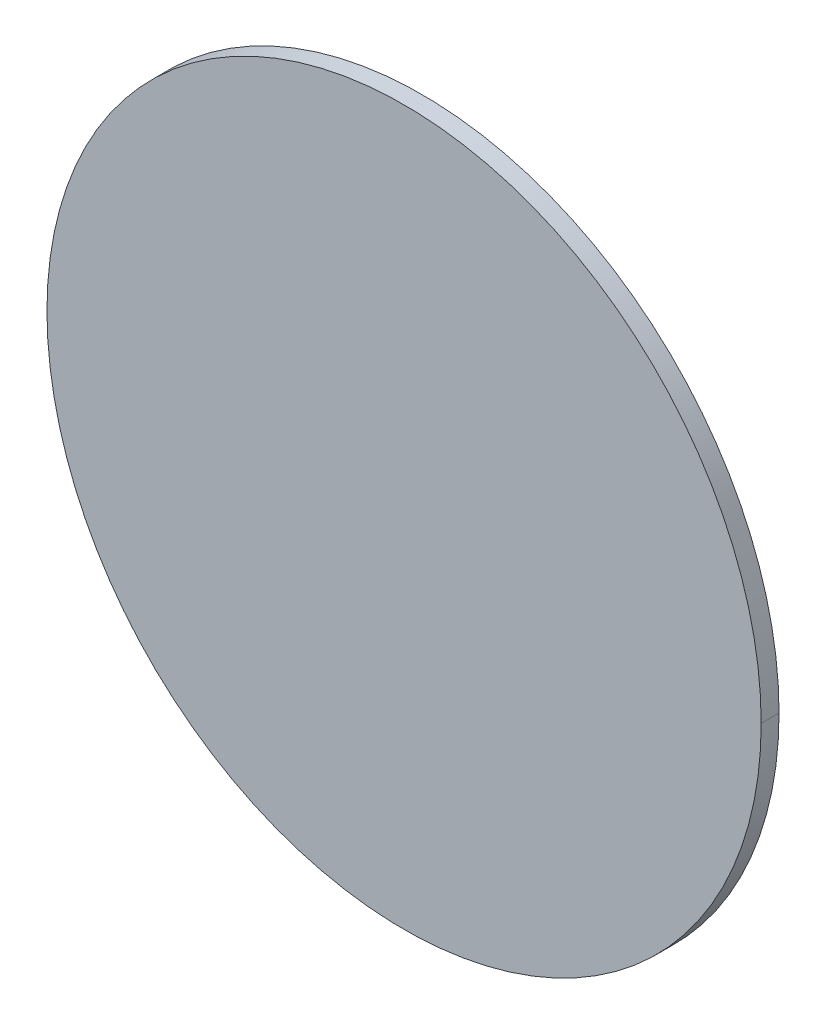
ISO-10303-21;
HEADER;
FILE_DESCRIPTION(('STEP AP214'),'2;1');
FILE_NAME('part.step','',(''),(''),'','','');
FILE_SCHEMA(('AUTOMOTIVE_DESIGN { 1 0 10303 214 1 1 1 1 }'));
ENDSEC;
DATA;
#1=APPLICATION_CONTEXT('core data for automotive mechanical design processes');
#2=APPLICATION_PROTOCOL_DEFINITION('international standard','automotive_design',2000,#1);
#3=PRODUCT_CONTEXT('',#1,'mechanical');
#4=PRODUCT('Part','Part','',(#3));
#5=PRODUCT_RELATED_PRODUCT_CATEGORY('part','',(#4));
#6=PRODUCT_DEFINITION_FORMATION('','',#4);
#7=PRODUCT_DEFINITION_CONTEXT('part definition',#1,'design');
#8=PRODUCT_DEFINITION('design','',#6,#7);
#9=PRODUCT_DEFINITION_SHAPE('','',#8);
#10=(LENGTH_UNIT() NAMED_UNIT(*) SI_UNIT(.MILLI.,.METRE.));
#11=(NAMED_UNIT(*) PLANE_ANGLE_UNIT() SI_UNIT($,.RADIAN.));
#12=(NAMED_UNIT(*) SI_UNIT($,.STERADIAN.) SOLID_ANGLE_UNIT());
#13=UNCERTAINTY_MEASURE_WITH_UNIT(LENGTH_MEASURE(1.E-05),#10,'distance_accuracy_value','');
#14=(GEOMETRIC_REPRESENTATION_CONTEXT(3) GLOBAL_UNCERTAINTY_ASSIGNED_CONTEXT((#13)) GLOBAL_UNIT_ASSIGNED_CONTEXT((#10,
#11,#12)) REPRESENTATION_CONTEXT('',''));
#15=CARTESIAN_POINT('',(0.,0.,0.));
#16=DIRECTION('',(0.,0.,1.));
#17=DIRECTION('',(1.,0.,0.));
#18=AXIS2_PLACEMENT_3D('',#15,#16,#17);
#19=CARTESIAN_POINT('',(0.4,0.,0.));
#20=DIRECTION('',(0.,0.,-1.));
#21=DIRECTION('',(0.,-1.,0.));
#22=AXIS2_PLACEMENT_3D('',#19,#20,#21);
#23=PLANE('',#22);
#24=CARTESIAN_POINT('',(0.,0.,0.));
#25=DIRECTION('',(0.,0.,-1.));
#26=DIRECTION('',(-1.,0.,0.));
#27=AXIS2_PLACEMENT_3D('',#24,#25,#26);
#28=CIRCLE('',#27,0.4);
#29=CARTESIAN_POINT('',(-0.4,0.,0.));
#30=VERTEX_POINT('',#29);
#31=CARTESIAN_POINT('',(0.4,0.,0.));
#32=VERTEX_POINT('',#31);
#33=EDGE_CURVE('E62',#30,#32,#28,.T.);
#34=ORIENTED_EDGE('',*,*,#33,.T.);
#35=CARTESIAN_POINT('',(0.,0.,0.));
#36=DIRECTION('',(0.,0.,-1.));
#37=DIRECTION('',(-1.,0.,0.));
#38=AXIS2_PLACEMENT_3D('',#35,#36,#37);
#39=CIRCLE('',#38,0.4);
#40=EDGE_CURVE('E11',#32,#30,#39,.T.);
#41=ORIENTED_EDGE('',*,*,#40,.T.);
#42=EDGE_LOOP('',(#34,#41));
#43=FACE_BOUND('',#42,.T.);
#44=ADVANCED_FACE('F17',(#43),#23,.T.);
#45=CARTESIAN_POINT('',(0.,0.,0.));
#46=DIRECTION('',(0.,0.,-1.));
#47=DIRECTION('',(-1.,0.,0.));
#48=AXIS2_PLACEMENT_3D('',#45,#46,#47);
#49=CYLINDRICAL_SURFACE('',#48,0.4);
#50=DIRECTION('',(0.,0.,-1.));
#51=VECTOR('',#50,1.);
#52=CARTESIAN_POINT('',(0.4,0.,0.));
#53=LINE('',#52,#51);
#54=CARTESIAN_POINT('',(0.4,0.,0.02));
#55=VERTEX_POINT('',#54);
#56=EDGE_CURVE('E54',#55,#32,#53,.T.);
#57=ORIENTED_EDGE('',*,*,#56,.F.);
#58=CARTESIAN_POINT('',(0.,0.,0.02));
#59=DIRECTION('',(0.,0.,-1.));
#60=DIRECTION('',(-1.,0.,0.));
#61=AXIS2_PLACEMENT_3D('',#58,#59,#60);
#62=CIRCLE('',#61,0.4);
#63=CARTESIAN_POINT('',(-0.4,0.,0.02));
#64=VERTEX_POINT('',#63);
#65=EDGE_CURVE('E25',#55,#64,#62,.T.);
#66=ORIENTED_EDGE('',*,*,#65,.T.);
#67=DIRECTION('',(0.,0.,-1.));
#68=VECTOR('',#67,1.);
#69=CARTESIAN_POINT('',(-0.4,0.,0.));
#70=LINE('',#69,#68);
#71=EDGE_CURVE('E51',#64,#30,#70,.T.);
#72=ORIENTED_EDGE('',*,*,#71,.T.);
#73=ORIENTED_EDGE('',*,*,#40,.F.);
#74=EDGE_LOOP('',(#57,#66,#72,#73));
#75=FACE_BOUND('',#74,.T.);
#76=ADVANCED_FACE('F50',(#75),#49,.T.);
#77=CARTESIAN_POINT('',(0.4,0.,0.02));
#78=DIRECTION('',(0.,0.,-1.));
#79=DIRECTION('',(0.,-1.,0.));
#80=AXIS2_PLACEMENT_3D('',#77,#78,#79);
#81=PLANE('',#80);
#82=CARTESIAN_POINT('',(0.,0.,0.02));
#83=DIRECTION('',(0.,0.,-1.));
#84=DIRECTION('',(-1.,0.,0.));
#85=AXIS2_PLACEMENT_3D('',#82,#83,#84);
#86=CIRCLE('',#85,0.4);
#87=EDGE_CURVE('E61',#64,#55,#86,.T.);
#88=ORIENTED_EDGE('',*,*,#87,.F.);
#89=ORIENTED_EDGE('',*,*,#65,.F.);
#90=EDGE_LOOP('',(#88,#89));
#91=FACE_BOUND('',#90,.T.);
#92=ADVANCED_FACE('F65',(#91),#81,.F.);
#93=CARTESIAN_POINT('',(0.,0.,0.));
#94=DIRECTION('',(0.,0.,-1.));
#95=DIRECTION('',(-1.,0.,0.));
#96=AXIS2_PLACEMENT_3D('',#93,#94,#95);
#97=CYLINDRICAL_SURFACE('',#96,0.4);
#98=ORIENTED_EDGE('',*,*,#87,.T.);
#99=ORIENTED_EDGE('',*,*,#56,.T.);
#100=ORIENTED_EDGE('',*,*,#33,.F.);
#101=ORIENTED_EDGE('',*,*,#71,.F.);
#102=EDGE_LOOP('',(#98,#99,#100,#101));
#103=FACE_BOUND('',#102,.T.);
#104=ADVANCED_FACE('F60',(#103),#97,.T.);
#105=CLOSED_SHELL('',(#44,#76,#92,#104));
#106=MANIFOLD_SOLID_BREP('B1',#105);
#107=ADVANCED_BREP_SHAPE_REPRESENTATION('',(#18,#106),#14);
#108=SHAPE_DEFINITION_REPRESENTATION(#9,#107);
ENDSEC;
END-ISO-10303-21;
